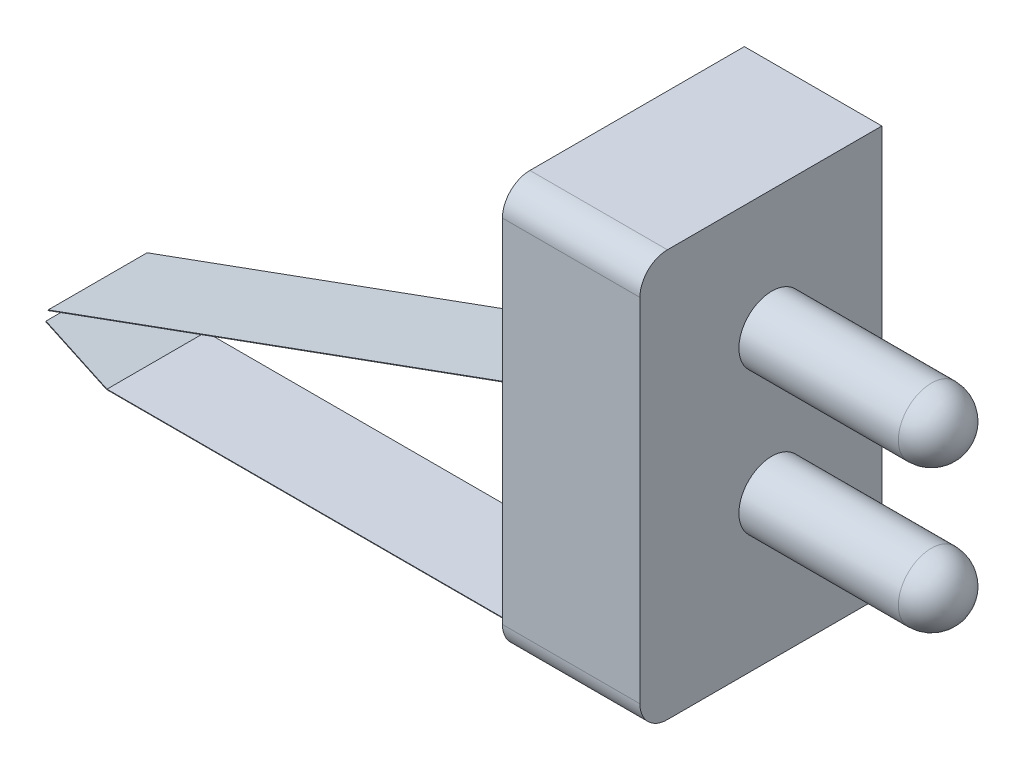
ISO-10303-21;
HEADER;
FILE_DESCRIPTION(('STEP AP214'),'2;1');
FILE_NAME('part.step','',(''),(''),'','','');
FILE_SCHEMA(('AUTOMOTIVE_DESIGN { 1 0 10303 214 1 1 1 1 }'));
ENDSEC;
DATA;
#1=APPLICATION_CONTEXT('core data for automotive mechanical design processes');
#2=APPLICATION_PROTOCOL_DEFINITION('international standard','automotive_design',2000,#1);
#3=PRODUCT_CONTEXT('',#1,'mechanical');
#4=PRODUCT('Part','Part','',(#3));
#5=PRODUCT_RELATED_PRODUCT_CATEGORY('part','',(#4));
#6=PRODUCT_DEFINITION_FORMATION('','',#4);
#7=PRODUCT_DEFINITION_CONTEXT('part definition',#1,'design');
#8=PRODUCT_DEFINITION('design','',#6,#7);
#9=PRODUCT_DEFINITION_SHAPE('','',#8);
#10=(LENGTH_UNIT() NAMED_UNIT(*) SI_UNIT(.MILLI.,.METRE.));
#11=(NAMED_UNIT(*) PLANE_ANGLE_UNIT() SI_UNIT($,.RADIAN.));
#12=(NAMED_UNIT(*) SI_UNIT($,.STERADIAN.) SOLID_ANGLE_UNIT());
#13=UNCERTAINTY_MEASURE_WITH_UNIT(LENGTH_MEASURE(1.E-05),#10,'distance_accuracy_value','');
#14=(GEOMETRIC_REPRESENTATION_CONTEXT(3) GLOBAL_UNCERTAINTY_ASSIGNED_CONTEXT((#13)) GLOBAL_UNIT_ASSIGNED_CONTEXT((#10,
#11,#12)) REPRESENTATION_CONTEXT('',''));
#15=CARTESIAN_POINT('',(0.,0.,0.));
#16=DIRECTION('',(0.,0.,1.));
#17=DIRECTION('',(1.,0.,0.));
#18=AXIS2_PLACEMENT_3D('',#15,#16,#17);
#19=CARTESIAN_POINT('',(-6.35,8.128,4.318));
#20=DIRECTION('',(1.,0.,0.));
#21=DIRECTION('',(0.,0.,-1.));
#22=AXIS2_PLACEMENT_3D('',#19,#20,#21);
#23=PLANE('',#22);
#24=DIRECTION('',(0.,0.,-1.));
#25=VECTOR('',#24,1.);
#26=CARTESIAN_POINT('',(-6.35,-9.398,4.31799999999999));
#27=LINE('',#26,#25);
#28=CARTESIAN_POINT('',(-6.35,-9.398,-2.794));
#29=VERTEX_POINT('',#28);
#30=CARTESIAN_POINT('',(-6.35,-9.398,-5.588));
#31=VERTEX_POINT('',#30);
#32=EDGE_CURVE('E350',#29,#31,#27,.T.);
#33=ORIENTED_EDGE('',*,*,#32,.F.);
#34=DIRECTION('',(0.,1.,0.));
#35=VECTOR('',#34,1.);
#36=CARTESIAN_POINT('',(-6.35,8.128,-2.794));
#37=LINE('',#36,#35);
#38=CARTESIAN_POINT('',(-6.35,-3.3915090287865,-2.794));
#39=VERTEX_POINT('',#38);
#40=EDGE_CURVE('E11',#29,#39,#37,.T.);
#41=ORIENTED_EDGE('',*,*,#40,.T.);
#42=DIRECTION('',(0.,0.,1.));
#43=VECTOR('',#42,1.);
#44=CARTESIAN_POINT('',(-6.35,-3.3915090287865,-2.794));
#45=LINE('',#44,#43);
#46=CARTESIAN_POINT('',(-6.35,-3.3915090287865,1.778));
#47=VERTEX_POINT('',#46);
#48=EDGE_CURVE('E307',#39,#47,#45,.T.);
#49=ORIENTED_EDGE('',*,*,#48,.T.);
#50=DIRECTION('',(0.,1.,0.));
#51=VECTOR('',#50,1.);
#52=CARTESIAN_POINT('',(-6.35,8.128,1.778));
#53=LINE('',#52,#51);
#54=CARTESIAN_POINT('',(-6.35,-9.398,1.778));
#55=VERTEX_POINT('',#54);
#56=EDGE_CURVE('E45',#55,#47,#53,.T.);
#57=ORIENTED_EDGE('',*,*,#56,.F.);
#58=CARTESIAN_POINT('',(-6.35,-9.398,4.31799999999999));
#59=VERTEX_POINT('',#58);
#60=EDGE_CURVE('E351',#59,#55,#27,.T.);
#61=ORIENTED_EDGE('',*,*,#60,.F.);
#62=CARTESIAN_POINT('',(-6.35,-8.128,4.318));
#63=DIRECTION('',(1.,0.,0.));
#64=DIRECTION('',(0.,0.,1.));
#65=AXIS2_PLACEMENT_3D('',#62,#63,#64);
#66=CIRCLE('',#65,1.27);
#67=CARTESIAN_POINT('',(-6.35,-8.12799999999999,5.588));
#68=VERTEX_POINT('',#67);
#69=EDGE_CURVE('E347',#68,#59,#66,.T.);
#70=ORIENTED_EDGE('',*,*,#69,.F.);
#71=DIRECTION('',(0.,-1.,0.));
#72=VECTOR('',#71,1.);
#73=CARTESIAN_POINT('',(-6.35,-8.12799999999999,5.588));
#74=LINE('',#73,#72);
#75=CARTESIAN_POINT('',(-6.35,8.12799999999999,5.588));
#76=VERTEX_POINT('',#75);
#77=EDGE_CURVE('E344',#76,#68,#74,.T.);
#78=ORIENTED_EDGE('',*,*,#77,.F.);
#79=CARTESIAN_POINT('',(-6.35,8.128,4.318));
#80=DIRECTION('',(1.,0.,0.));
#81=DIRECTION('',(0.,0.,-1.));
#82=AXIS2_PLACEMENT_3D('',#79,#80,#81);
#83=CIRCLE('',#82,1.27);
#84=CARTESIAN_POINT('',(-6.35,9.398,4.31799999999999));
#85=VERTEX_POINT('',#84);
#86=EDGE_CURVE('E341',#85,#76,#83,.T.);
#87=ORIENTED_EDGE('',*,*,#86,.F.);
#88=DIRECTION('',(0.,0.,1.));
#89=VECTOR('',#88,1.);
#90=CARTESIAN_POINT('',(-6.35,9.398,4.31799999999999));
#91=LINE('',#90,#89);
#92=CARTESIAN_POINT('',(-6.35,9.398,-5.588));
#93=VERTEX_POINT('',#92);
#94=EDGE_CURVE('E337',#93,#85,#91,.T.);
#95=ORIENTED_EDGE('',*,*,#94,.F.);
#96=DIRECTION('',(0.,1.,0.));
#97=VECTOR('',#96,1.);
#98=CARTESIAN_POINT('',(-6.35,-9.398,-5.588));
#99=LINE('',#98,#97);
#100=EDGE_CURVE('E334',#31,#93,#99,.T.);
#101=ORIENTED_EDGE('',*,*,#100,.F.);
#102=EDGE_LOOP('',(#33,#41,#49,#57,#61,#70,#78,#87,#95,#101));
#103=FACE_BOUND('',#102,.T.);
#104=DIRECTION('',(0.,1.,0.));
#105=VECTOR('',#104,1.);
#106=CARTESIAN_POINT('',(-6.35,5.17132830273649,-2.794));
#107=LINE('',#106,#105);
#108=CARTESIAN_POINT('',(-6.35,-0.851509028786498,-2.794));
#109=VERTEX_POINT('',#108);
#110=CARTESIAN_POINT('',(-6.35,5.17132830273649,-2.794));
#111=VERTEX_POINT('',#110);
#112=EDGE_CURVE('E202',#109,#111,#107,.T.);
#113=ORIENTED_EDGE('',*,*,#112,.T.);
#114=DIRECTION('',(0.,0.,1.));
#115=VECTOR('',#114,1.);
#116=CARTESIAN_POINT('',(-6.35,5.17132830273649,-2.794));
#117=LINE('',#116,#115);
#118=CARTESIAN_POINT('',(-6.35,5.17132830273649,1.778));
#119=VERTEX_POINT('',#118);
#120=EDGE_CURVE('E217',#111,#119,#117,.T.);
#121=ORIENTED_EDGE('',*,*,#120,.T.);
#122=DIRECTION('',(0.,1.,0.));
#123=VECTOR('',#122,1.);
#124=CARTESIAN_POINT('',(-6.35,5.17132830273649,1.778));
#125=LINE('',#124,#123);
#126=CARTESIAN_POINT('',(-6.35,-0.851509028786498,1.778));
#127=VERTEX_POINT('',#126);
#128=EDGE_CURVE('E218',#127,#119,#125,.T.);
#129=ORIENTED_EDGE('',*,*,#128,.F.);
#130=DIRECTION('',(0.,0.,1.));
#131=VECTOR('',#130,1.);
#132=CARTESIAN_POINT('',(-6.35,-0.851509028786498,-2.794));
#133=LINE('',#132,#131);
#134=EDGE_CURVE('E240',#109,#127,#133,.T.);
#135=ORIENTED_EDGE('',*,*,#134,.F.);
#136=EDGE_LOOP('',(#113,#121,#129,#135));
#137=FACE_BOUND('',#136,.T.);
#138=ADVANCED_FACE('F37',(#103,#137),#23,.F.);
#139=CARTESIAN_POINT('',(-6.35,-9.398,-5.588));
#140=DIRECTION('',(0.,0.,-1.));
#141=DIRECTION('',(-1.,0.,0.));
#142=AXIS2_PLACEMENT_3D('',#139,#140,#141);
#143=PLANE('',#142);
#144=DIRECTION('',(0.,1.,0.));
#145=VECTOR('',#144,1.);
#146=CARTESIAN_POINT('',(0.,-9.398,-5.588));
#147=LINE('',#146,#145);
#148=CARTESIAN_POINT('',(0.,-9.398,-5.588));
#149=VERTEX_POINT('',#148);
#150=CARTESIAN_POINT('',(0.,9.398,-5.588));
#151=VERTEX_POINT('',#150);
#152=EDGE_CURVE('E356',#149,#151,#147,.T.);
#153=ORIENTED_EDGE('',*,*,#152,.F.);
#154=DIRECTION('',(1.,0.,0.));
#155=VECTOR('',#154,1.);
#156=CARTESIAN_POINT('',(-6.35,-9.398,-5.588));
#157=LINE('',#156,#155);
#158=EDGE_CURVE('E373',#31,#149,#157,.T.);
#159=ORIENTED_EDGE('',*,*,#158,.F.);
#160=ORIENTED_EDGE('',*,*,#100,.T.);
#161=DIRECTION('',(1.,0.,0.));
#162=VECTOR('',#161,1.);
#163=CARTESIAN_POINT('',(-6.35,9.398,-5.588));
#164=LINE('',#163,#162);
#165=EDGE_CURVE('E354',#93,#151,#164,.T.);
#166=ORIENTED_EDGE('',*,*,#165,.T.);
#167=EDGE_LOOP('',(#153,#159,#160,#166));
#168=FACE_BOUND('',#167,.T.);
#169=ADVANCED_FACE('F438',(#168),#143,.T.);
#170=CARTESIAN_POINT('',(-6.35,-9.398,4.31799999999999));
#171=DIRECTION('',(0.,-1.,0.));
#172=DIRECTION('',(0.,0.,-1.));
#173=AXIS2_PLACEMENT_3D('',#170,#171,#172);
#174=PLANE('',#173);
#175=DIRECTION('',(0.,0.,-1.));
#176=VECTOR('',#175,1.);
#177=CARTESIAN_POINT('',(0.,-9.398,4.31799999999999));
#178=LINE('',#177,#176);
#179=CARTESIAN_POINT('',(0.,-9.398,4.31799999999999));
#180=VERTEX_POINT('',#179);
#181=EDGE_CURVE('E338',#180,#149,#178,.T.);
#182=ORIENTED_EDGE('',*,*,#181,.F.);
#183=DIRECTION('',(1.,0.,0.));
#184=VECTOR('',#183,1.);
#185=CARTESIAN_POINT('',(-6.35,-9.398,4.31799999999999));
#186=LINE('',#185,#184);
#187=EDGE_CURVE('E375',#59,#180,#186,.T.);
#188=ORIENTED_EDGE('',*,*,#187,.F.);
#189=ORIENTED_EDGE('',*,*,#60,.T.);
#190=EDGE_CURVE('E355',#55,#29,#27,.T.);
#191=ORIENTED_EDGE('',*,*,#190,.T.);
#192=ORIENTED_EDGE('',*,*,#32,.T.);
#193=ORIENTED_EDGE('',*,*,#158,.T.);
#194=EDGE_LOOP('',(#182,#188,#189,#191,#192,#193));
#195=FACE_BOUND('',#194,.T.);
#196=ADVANCED_FACE('F434',(#195),#174,.T.);
#197=CARTESIAN_POINT('',(-6.35,-8.128,4.318));
#198=DIRECTION('',(1.,0.,0.));
#199=DIRECTION('',(0.,0.,-1.));
#200=AXIS2_PLACEMENT_3D('',#197,#198,#199);
#201=CYLINDRICAL_SURFACE('',#200,1.27);
#202=CARTESIAN_POINT('',(0.,-8.128,4.318));
#203=DIRECTION('',(1.,0.,0.));
#204=DIRECTION('',(0.,0.,1.));
#205=AXIS2_PLACEMENT_3D('',#202,#203,#204);
#206=CIRCLE('',#205,1.27);
#207=CARTESIAN_POINT('',(0.,-8.12799999999999,5.588));
#208=VERTEX_POINT('',#207);
#209=EDGE_CURVE('E368',#208,#180,#206,.T.);
#210=ORIENTED_EDGE('',*,*,#209,.F.);
#211=DIRECTION('',(1.,0.,0.));
#212=VECTOR('',#211,1.);
#213=CARTESIAN_POINT('',(-6.35,-8.12799999999999,5.588));
#214=LINE('',#213,#212);
#215=EDGE_CURVE('E377',#68,#208,#214,.T.);
#216=ORIENTED_EDGE('',*,*,#215,.F.);
#217=ORIENTED_EDGE('',*,*,#69,.T.);
#218=ORIENTED_EDGE('',*,*,#187,.T.);
#219=EDGE_LOOP('',(#210,#216,#217,#218));
#220=FACE_BOUND('',#219,.T.);
#221=ADVANCED_FACE('F452',(#220),#201,.T.);
#222=CARTESIAN_POINT('',(-6.35,-8.12799999999999,5.588));
#223=DIRECTION('',(0.,0.,1.));
#224=DIRECTION('',(1.,0.,0.));
#225=AXIS2_PLACEMENT_3D('',#222,#223,#224);
#226=PLANE('',#225);
#227=DIRECTION('',(0.,-1.,0.));
#228=VECTOR('',#227,1.);
#229=CARTESIAN_POINT('',(0.,-8.12799999999999,5.588));
#230=LINE('',#229,#228);
#231=CARTESIAN_POINT('',(0.,8.12799999999999,5.588));
#232=VERTEX_POINT('',#231);
#233=EDGE_CURVE('E365',#232,#208,#230,.T.);
#234=ORIENTED_EDGE('',*,*,#233,.F.);
#235=DIRECTION('',(1.,0.,0.));
#236=VECTOR('',#235,1.);
#237=CARTESIAN_POINT('',(-6.35,8.12799999999999,5.588));
#238=LINE('',#237,#236);
#239=EDGE_CURVE('E379',#76,#232,#238,.T.);
#240=ORIENTED_EDGE('',*,*,#239,.F.);
#241=ORIENTED_EDGE('',*,*,#77,.T.);
#242=ORIENTED_EDGE('',*,*,#215,.T.);
#243=EDGE_LOOP('',(#234,#240,#241,#242));
#244=FACE_BOUND('',#243,.T.);
#245=ADVANCED_FACE('F455',(#244),#226,.T.);
#246=CARTESIAN_POINT('',(-6.35,8.128,4.318));
#247=DIRECTION('',(1.,0.,0.));
#248=DIRECTION('',(0.,0.,-1.));
#249=AXIS2_PLACEMENT_3D('',#246,#247,#248);
#250=CYLINDRICAL_SURFACE('',#249,1.27);
#251=CARTESIAN_POINT('',(0.,8.128,4.318));
#252=DIRECTION('',(1.,0.,0.));
#253=DIRECTION('',(0.,0.,-1.));
#254=AXIS2_PLACEMENT_3D('',#251,#252,#253);
#255=CIRCLE('',#254,1.27);
#256=CARTESIAN_POINT('',(0.,9.398,4.31799999999999));
#257=VERTEX_POINT('',#256);
#258=EDGE_CURVE('E362',#257,#232,#255,.T.);
#259=ORIENTED_EDGE('',*,*,#258,.F.);
#260=DIRECTION('',(1.,0.,0.));
#261=VECTOR('',#260,1.);
#262=CARTESIAN_POINT('',(-6.35,9.398,4.31799999999999));
#263=LINE('',#262,#261);
#264=EDGE_CURVE('E381',#85,#257,#263,.T.);
#265=ORIENTED_EDGE('',*,*,#264,.F.);
#266=ORIENTED_EDGE('',*,*,#86,.T.);
#267=ORIENTED_EDGE('',*,*,#239,.T.);
#268=EDGE_LOOP('',(#259,#265,#266,#267));
#269=FACE_BOUND('',#268,.T.);
#270=ADVANCED_FACE('F457',(#269),#250,.T.);
#271=CARTESIAN_POINT('',(-6.35,9.398,4.31799999999999));
#272=DIRECTION('',(0.,1.,0.));
#273=DIRECTION('',(0.,0.,1.));
#274=AXIS2_PLACEMENT_3D('',#271,#272,#273);
#275=PLANE('',#274);
#276=DIRECTION('',(0.,0.,1.));
#277=VECTOR('',#276,1.);
#278=CARTESIAN_POINT('',(0.,9.398,4.31799999999999));
#279=LINE('',#278,#277);
#280=EDGE_CURVE('E359',#151,#257,#279,.T.);
#281=ORIENTED_EDGE('',*,*,#280,.F.);
#282=ORIENTED_EDGE('',*,*,#165,.F.);
#283=ORIENTED_EDGE('',*,*,#94,.T.);
#284=ORIENTED_EDGE('',*,*,#264,.T.);
#285=EDGE_LOOP('',(#281,#282,#283,#284));
#286=FACE_BOUND('',#285,.T.);
#287=ADVANCED_FACE('F445',(#286),#275,.T.);
#288=CARTESIAN_POINT('',(0.,8.128,4.318));
#289=DIRECTION('',(1.,0.,0.));
#290=DIRECTION('',(0.,0.,-1.));
#291=AXIS2_PLACEMENT_3D('',#288,#289,#290);
#292=PLANE('',#291);
#293=CARTESIAN_POINT('',(0.,3.81,-0.508000000000002));
#294=DIRECTION('',(1.,0.,0.));
#295=DIRECTION('',(0.,0.,-1.));
#296=AXIS2_PLACEMENT_3D('',#293,#294,#295);
#297=CIRCLE('',#296,1.524);
#298=CARTESIAN_POINT('',(0.,3.81,-2.032));
#299=VERTEX_POINT('',#298);
#300=EDGE_CURVE('E327',#299,#299,#297,.T.);
#301=ORIENTED_EDGE('',*,*,#300,.F.);
#302=EDGE_LOOP('',(#301));
#303=FACE_BOUND('',#302,.T.);
#304=CARTESIAN_POINT('',(0.,-2.794,-0.508000000000002));
#305=DIRECTION('',(1.,0.,0.));
#306=DIRECTION('',(0.,0.,-1.));
#307=AXIS2_PLACEMENT_3D('',#304,#305,#306);
#308=CIRCLE('',#307,1.524);
#309=CARTESIAN_POINT('',(0.,-2.794,-2.032));
#310=VERTEX_POINT('',#309);
#311=EDGE_CURVE('E330',#310,#310,#308,.T.);
#312=ORIENTED_EDGE('',*,*,#311,.F.);
#313=EDGE_LOOP('',(#312));
#314=FACE_BOUND('',#313,.T.);
#315=ORIENTED_EDGE('',*,*,#152,.T.);
#316=ORIENTED_EDGE('',*,*,#280,.T.);
#317=ORIENTED_EDGE('',*,*,#258,.T.);
#318=ORIENTED_EDGE('',*,*,#233,.T.);
#319=ORIENTED_EDGE('',*,*,#209,.T.);
#320=ORIENTED_EDGE('',*,*,#181,.T.);
#321=EDGE_LOOP('',(#315,#316,#317,#318,#319,#320));
#322=FACE_BOUND('',#321,.T.);
#323=ADVANCED_FACE('F448',(#303,#314,#322),#292,.T.);
#324=CARTESIAN_POINT('',(7.366,-2.794,-0.508000000000002));
#325=DIRECTION('',(-1.,0.,0.));
#326=DIRECTION('',(0.,0.,1.));
#327=AXIS2_PLACEMENT_3D('',#324,#325,#326);
#328=CYLINDRICAL_SURFACE('',#327,1.524);
#329=CARTESIAN_POINT('',(7.366,-2.794,-0.508000000000002));
#330=DIRECTION('',(1.,0.,0.));
#331=DIRECTION('',(0.,0.,-1.));
#332=AXIS2_PLACEMENT_3D('',#329,#330,#331);
#333=CIRCLE('',#332,1.524);
#334=CARTESIAN_POINT('',(7.366,-2.794,-2.032));
#335=VERTEX_POINT('',#334);
#336=EDGE_CURVE('E333',#335,#335,#333,.T.);
#337=ORIENTED_EDGE('',*,*,#336,.F.);
#338=EDGE_LOOP('',(#337));
#339=FACE_BOUND('',#338,.T.);
#340=ORIENTED_EDGE('',*,*,#311,.T.);
#341=EDGE_LOOP('',(#340));
#342=FACE_BOUND('',#341,.T.);
#343=ADVANCED_FACE('F474',(#339,#342),#328,.T.);
#344=CARTESIAN_POINT('',(7.366,-2.794,-0.508000000000002));
#345=DIRECTION('',(0.,0.,1.));
#346=DIRECTION('',(1.,0.,0.));
#347=AXIS2_PLACEMENT_3D('',#344,#345,#346);
#348=SPHERICAL_SURFACE('',#347,1.524);
#349=CARTESIAN_POINT('',(7.366,-2.794,-0.508000000000002));
#350=DIRECTION('',(1.,0.,0.));
#351=DIRECTION('',(0.,0.,-1.));
#352=AXIS2_PLACEMENT_3D('',#349,#350,#351);
#353=SPHERICAL_SURFACE('',#352,1.524);
#354=ORIENTED_EDGE('',*,*,#336,.T.);
#355=EDGE_LOOP('',(#354));
#356=FACE_BOUND('',#355,.T.);
#357=ADVANCED_FACE('F39',(#356),#353,.T.);
#358=CARTESIAN_POINT('',(7.366,3.81,-0.508000000000002));
#359=DIRECTION('',(-1.,0.,0.));
#360=DIRECTION('',(0.,0.,1.));
#361=AXIS2_PLACEMENT_3D('',#358,#359,#360);
#362=CYLINDRICAL_SURFACE('',#361,1.524);
#363=CARTESIAN_POINT('',(7.366,3.81,-0.508000000000002));
#364=DIRECTION('',(1.,0.,0.));
#365=DIRECTION('',(0.,0.,-1.));
#366=AXIS2_PLACEMENT_3D('',#363,#364,#365);
#367=CIRCLE('',#366,1.524);
#368=CARTESIAN_POINT('',(7.366,3.81,-2.032));
#369=VERTEX_POINT('',#368);
#370=EDGE_CURVE('E309',#369,#369,#367,.T.);
#371=ORIENTED_EDGE('',*,*,#370,.F.);
#372=EDGE_LOOP('',(#371));
#373=FACE_BOUND('',#372,.T.);
#374=ORIENTED_EDGE('',*,*,#300,.T.);
#375=EDGE_LOOP('',(#374));
#376=FACE_BOUND('',#375,.T.);
#377=ADVANCED_FACE('F518',(#373,#376),#362,.T.);
#378=CARTESIAN_POINT('',(7.366,3.81,-0.508000000000002));
#379=DIRECTION('',(0.,0.,1.));
#380=DIRECTION('',(1.,0.,0.));
#381=AXIS2_PLACEMENT_3D('',#378,#379,#380);
#382=SPHERICAL_SURFACE('',#381,1.524);
#383=CARTESIAN_POINT('',(7.366,3.81,-0.508000000000002));
#384=DIRECTION('',(1.,0.,0.));
#385=DIRECTION('',(0.,0.,-1.));
#386=AXIS2_PLACEMENT_3D('',#383,#384,#385);
#387=SPHERICAL_SURFACE('',#386,1.524);
#388=ORIENTED_EDGE('',*,*,#370,.T.);
#389=EDGE_LOOP('',(#388));
#390=FACE_BOUND('',#389,.T.);
#391=ADVANCED_FACE('F523',(#390),#387,.T.);
#392=CARTESIAN_POINT('',(-6.35,-3.3915090287865,-2.794));
#393=DIRECTION('',(0.,1.,0.));
#394=DIRECTION('',(-1.,0.,0.));
#395=AXIS2_PLACEMENT_3D('',#392,#393,#394);
#396=PLANE('',#395);
#397=DIRECTION('',(-1.,0.,0.));
#398=VECTOR('',#397,1.);
#399=CARTESIAN_POINT('',(-6.35,-3.3915090287865,1.778));
#400=LINE('',#399,#398);
#401=CARTESIAN_POINT('',(-6.3754,-3.3915090287865,1.778));
#402=VERTEX_POINT('',#401);
#403=EDGE_CURVE('E239',#47,#402,#400,.T.);
#404=ORIENTED_EDGE('',*,*,#403,.F.);
#405=ORIENTED_EDGE('',*,*,#48,.F.);
#406=DIRECTION('',(-1.,0.,0.));
#407=VECTOR('',#406,1.);
#408=CARTESIAN_POINT('',(-6.35,-3.3915090287865,-2.794));
#409=LINE('',#408,#407);
#410=CARTESIAN_POINT('',(-6.3754,-3.3915090287865,-2.794));
#411=VERTEX_POINT('',#410);
#412=EDGE_CURVE('E247',#39,#411,#409,.T.);
#413=ORIENTED_EDGE('',*,*,#412,.T.);
#414=DIRECTION('',(0.,0.,1.));
#415=VECTOR('',#414,1.);
#416=CARTESIAN_POINT('',(-6.3754,-3.3915090287865,-2.794));
#417=LINE('',#416,#415);
#418=EDGE_CURVE('E278',#411,#402,#417,.T.);
#419=ORIENTED_EDGE('',*,*,#418,.T.);
#420=EDGE_LOOP('',(#404,#405,#413,#419));
#421=FACE_BOUND('',#420,.T.);
#422=ADVANCED_FACE('F394',(#421),#396,.T.);
#423=CARTESIAN_POINT('',(-6.35,-3.3915090287865,-2.794));
#424=DIRECTION('',(1.,0.,0.));
#425=DIRECTION('',(0.,1.,0.));
#426=AXIS2_PLACEMENT_3D('',#423,#424,#425);
#427=PLANE('',#426);
#428=DIRECTION('',(0.,1.,0.));
#429=VECTOR('',#428,1.);
#430=CARTESIAN_POINT('',(-6.35,-3.3915090287865,-2.794));
#431=LINE('',#430,#429);
#432=CARTESIAN_POINT('',(-6.35,-9.68399891999999,-2.794));
#433=VERTEX_POINT('',#432);
#434=EDGE_CURVE('E275',#433,#29,#431,.T.);
#435=ORIENTED_EDGE('',*,*,#434,.T.);
#436=ORIENTED_EDGE('',*,*,#190,.F.);
#437=DIRECTION('',(0.,1.,0.));
#438=VECTOR('',#437,1.);
#439=CARTESIAN_POINT('',(-6.35,-3.3915090287865,1.778));
#440=LINE('',#439,#438);
#441=CARTESIAN_POINT('',(-6.35,-9.68399891999999,1.778));
#442=VERTEX_POINT('',#441);
#443=EDGE_CURVE('E251',#442,#55,#440,.T.);
#444=ORIENTED_EDGE('',*,*,#443,.F.);
#445=DIRECTION('',(0.,0.,1.));
#446=VECTOR('',#445,1.);
#447=CARTESIAN_POINT('',(-6.35,-9.68399891999999,-2.794));
#448=LINE('',#447,#446);
#449=EDGE_CURVE('E310',#433,#442,#448,.T.);
#450=ORIENTED_EDGE('',*,*,#449,.F.);
#451=EDGE_LOOP('',(#435,#436,#444,#450));
#452=FACE_BOUND('',#451,.T.);
#453=ADVANCED_FACE('F428',(#452),#427,.T.);
#454=CARTESIAN_POINT('',(-8.35000108,-9.68399892,-2.794));
#455=DIRECTION('',(0.,0.,1.));
#456=DIRECTION('',(1.,0.,0.));
#457=AXIS2_PLACEMENT_3D('',#454,#455,#456);
#458=CYLINDRICAL_SURFACE('',#457,2.00000108);
#459=CARTESIAN_POINT('',(-8.35000108,-9.68399892,1.778));
#460=DIRECTION('',(0.,0.,1.));
#461=DIRECTION('',(-1.,0.,0.));
#462=AXIS2_PLACEMENT_3D('',#459,#460,#461);
#463=CIRCLE('',#462,2.00000108);
#464=CARTESIAN_POINT('',(-8.35000108000001,-11.684,1.778));
#465=VERTEX_POINT('',#464);
#466=EDGE_CURVE('E302',#465,#442,#463,.T.);
#467=ORIENTED_EDGE('',*,*,#466,.F.);
#468=DIRECTION('',(0.,0.,1.));
#469=VECTOR('',#468,1.);
#470=CARTESIAN_POINT('',(-8.35000108000001,-11.684,-2.794));
#471=LINE('',#470,#469);
#472=CARTESIAN_POINT('',(-8.35000108000001,-11.684,-2.794));
#473=VERTEX_POINT('',#472);
#474=EDGE_CURVE('E312',#473,#465,#471,.T.);
#475=ORIENTED_EDGE('',*,*,#474,.F.);
#476=CARTESIAN_POINT('',(-8.35000108,-9.68399892,-2.794));
#477=DIRECTION('',(0.,0.,1.));
#478=DIRECTION('',(-1.,0.,0.));
#479=AXIS2_PLACEMENT_3D('',#476,#477,#478);
#480=CIRCLE('',#479,2.00000108);
#481=EDGE_CURVE('E272',#473,#433,#480,.T.);
#482=ORIENTED_EDGE('',*,*,#481,.T.);
#483=ORIENTED_EDGE('',*,*,#449,.T.);
#484=EDGE_LOOP('',(#467,#475,#482,#483));
#485=FACE_BOUND('',#484,.T.);
#486=ADVANCED_FACE('F573',(#485),#458,.T.);
#487=CARTESIAN_POINT('',(-8.35000108000001,-11.684,-2.794));
#488=DIRECTION('',(0.,-1.,0.));
#489=DIRECTION('',(1.,0.,0.));
#490=AXIS2_PLACEMENT_3D('',#487,#488,#489);
#491=PLANE('',#490);
#492=DIRECTION('',(1.,0.,0.));
#493=VECTOR('',#492,1.);
#494=CARTESIAN_POINT('',(-8.35000108000001,-11.684,1.778));
#495=LINE('',#494,#493);
#496=CARTESIAN_POINT('',(-28.448,-11.684,1.778));
#497=VERTEX_POINT('',#496);
#498=EDGE_CURVE('E299',#497,#465,#495,.T.);
#499=ORIENTED_EDGE('',*,*,#498,.F.);
#500=DIRECTION('',(0.,0.,1.));
#501=VECTOR('',#500,1.);
#502=CARTESIAN_POINT('',(-28.448,-11.684,-2.794));
#503=LINE('',#502,#501);
#504=CARTESIAN_POINT('',(-28.448,-11.684,-2.794));
#505=VERTEX_POINT('',#504);
#506=EDGE_CURVE('E314',#505,#497,#503,.T.);
#507=ORIENTED_EDGE('',*,*,#506,.F.);
#508=DIRECTION('',(1.,0.,0.));
#509=VECTOR('',#508,1.);
#510=CARTESIAN_POINT('',(-8.35000108000001,-11.684,-2.794));
#511=LINE('',#510,#509);
#512=EDGE_CURVE('E269',#505,#473,#511,.T.);
#513=ORIENTED_EDGE('',*,*,#512,.T.);
#514=ORIENTED_EDGE('',*,*,#474,.T.);
#515=EDGE_LOOP('',(#499,#507,#513,#514));
#516=FACE_BOUND('',#515,.T.);
#517=ADVANCED_FACE('F423',(#516),#491,.T.);
#518=CARTESIAN_POINT('',(-28.448,-11.684,-2.794));
#519=DIRECTION('',(-0.4226182617407,-0.906307787036649,0.));
#520=DIRECTION('',(0.906307787036649,-0.4226182617407,0.));
#521=AXIS2_PLACEMENT_3D('',#518,#519,#520);
#522=PLANE('',#521);
#523=DIRECTION('',(0.906307787036649,-0.4226182617407,0.));
#524=VECTOR('',#523,1.);
#525=CARTESIAN_POINT('',(-28.448,-11.684,1.778));
#526=LINE('',#525,#524);
#527=CARTESIAN_POINT('',(-31.242,-10.3811364031149,1.778));
#528=VERTEX_POINT('',#527);
#529=EDGE_CURVE('E296',#528,#497,#526,.T.);
#530=ORIENTED_EDGE('',*,*,#529,.F.);
#531=DIRECTION('',(0.,0.,1.));
#532=VECTOR('',#531,1.);
#533=CARTESIAN_POINT('',(-31.242,-10.3811364031149,-2.794));
#534=LINE('',#533,#532);
#535=CARTESIAN_POINT('',(-31.242,-10.3811364031149,-2.794));
#536=VERTEX_POINT('',#535);
#537=EDGE_CURVE('E316',#536,#528,#534,.T.);
#538=ORIENTED_EDGE('',*,*,#537,.F.);
#539=DIRECTION('',(0.906307787036649,-0.4226182617407,0.));
#540=VECTOR('',#539,1.);
#541=CARTESIAN_POINT('',(-28.448,-11.684,-2.794));
#542=LINE('',#541,#540);
#543=EDGE_CURVE('E266',#536,#505,#542,.T.);
#544=ORIENTED_EDGE('',*,*,#543,.T.);
#545=ORIENTED_EDGE('',*,*,#506,.T.);
#546=EDGE_LOOP('',(#530,#538,#544,#545));
#547=FACE_BOUND('',#546,.T.);
#548=ADVANCED_FACE('F419',(#547),#522,.T.);
#549=CARTESIAN_POINT('',(-31.242,-10.3443251730549,-2.794));
#550=DIRECTION('',(-1.,0.,0.));
#551=DIRECTION('',(0.,0.,1.));
#552=AXIS2_PLACEMENT_3D('',#549,#550,#551);
#553=PLANE('',#552);
#554=DIRECTION('',(0.,-1.,0.));
#555=VECTOR('',#554,1.);
#556=CARTESIAN_POINT('',(-31.242,-10.3443251730549,1.778));
#557=LINE('',#556,#555);
#558=CARTESIAN_POINT('',(-31.242,-10.3443251730549,1.778));
#559=VERTEX_POINT('',#558);
#560=EDGE_CURVE('E293',#559,#528,#557,.T.);
#561=ORIENTED_EDGE('',*,*,#560,.F.);
#562=DIRECTION('',(0.,0.,1.));
#563=VECTOR('',#562,1.);
#564=CARTESIAN_POINT('',(-31.242,-10.3443251730549,-2.794));
#565=LINE('',#564,#563);
#566=CARTESIAN_POINT('',(-31.242,-10.3443251730549,-2.794));
#567=VERTEX_POINT('',#566);
#568=EDGE_CURVE('E318',#567,#559,#565,.T.);
#569=ORIENTED_EDGE('',*,*,#568,.F.);
#570=DIRECTION('',(0.,-1.,0.));
#571=VECTOR('',#570,1.);
#572=CARTESIAN_POINT('',(-31.242,-10.3443251730549,-2.794));
#573=LINE('',#572,#571);
#574=EDGE_CURVE('E263',#567,#536,#573,.T.);
#575=ORIENTED_EDGE('',*,*,#574,.T.);
#576=ORIENTED_EDGE('',*,*,#537,.T.);
#577=EDGE_LOOP('',(#561,#569,#575,#576));
#578=FACE_BOUND('',#577,.T.);
#579=ADVANCED_FACE('F415',(#578),#553,.T.);
#580=CARTESIAN_POINT('',(-28.4248123593041,-11.6586,-2.794));
#581=DIRECTION('',(0.422776435852255,0.906234012431703,0.));
#582=DIRECTION('',(-0.906234012431703,0.422776435852255,0.));
#583=AXIS2_PLACEMENT_3D('',#580,#581,#582);
#584=PLANE('',#583);
#585=DIRECTION('',(-0.906234012431703,0.422776435852255,0.));
#586=VECTOR('',#585,1.);
#587=CARTESIAN_POINT('',(-28.4248123593041,-11.6586,1.778));
#588=LINE('',#587,#586);
#589=CARTESIAN_POINT('',(-28.4248123593041,-11.6586,1.778));
#590=VERTEX_POINT('',#589);
#591=EDGE_CURVE('E290',#590,#559,#588,.T.);
#592=ORIENTED_EDGE('',*,*,#591,.F.);
#593=DIRECTION('',(0.,0.,1.));
#594=VECTOR('',#593,1.);
#595=CARTESIAN_POINT('',(-28.4248123593041,-11.6586,-2.794));
#596=LINE('',#595,#594);
#597=CARTESIAN_POINT('',(-28.4248123593041,-11.6586,-2.794));
#598=VERTEX_POINT('',#597);
#599=EDGE_CURVE('E320',#598,#590,#596,.T.);
#600=ORIENTED_EDGE('',*,*,#599,.F.);
#601=DIRECTION('',(-0.906234012431703,0.422776435852255,0.));
#602=VECTOR('',#601,1.);
#603=CARTESIAN_POINT('',(-28.4248123593041,-11.6586,-2.794));
#604=LINE('',#603,#602);
#605=EDGE_CURVE('E260',#598,#567,#604,.T.);
#606=ORIENTED_EDGE('',*,*,#605,.T.);
#607=ORIENTED_EDGE('',*,*,#568,.T.);
#608=EDGE_LOOP('',(#592,#600,#606,#607));
#609=FACE_BOUND('',#608,.T.);
#610=ADVANCED_FACE('F411',(#609),#584,.T.);
#611=CARTESIAN_POINT('',(-8.35000108000001,-11.6586,-2.794));
#612=DIRECTION('',(0.,1.,0.));
#613=DIRECTION('',(-1.,0.,0.));
#614=AXIS2_PLACEMENT_3D('',#611,#612,#613);
#615=PLANE('',#614);
#616=DIRECTION('',(-1.,0.,0.));
#617=VECTOR('',#616,1.);
#618=CARTESIAN_POINT('',(-8.35000108000001,-11.6586,1.778));
#619=LINE('',#618,#617);
#620=CARTESIAN_POINT('',(-8.35000108000001,-11.6586,1.778));
#621=VERTEX_POINT('',#620);
#622=EDGE_CURVE('E287',#621,#590,#619,.T.);
#623=ORIENTED_EDGE('',*,*,#622,.F.);
#624=DIRECTION('',(0.,0.,1.));
#625=VECTOR('',#624,1.);
#626=CARTESIAN_POINT('',(-8.35000108000001,-11.6586,-2.794));
#627=LINE('',#626,#625);
#628=CARTESIAN_POINT('',(-8.35000108000001,-11.6586,-2.794));
#629=VERTEX_POINT('',#628);
#630=EDGE_CURVE('E322',#629,#621,#627,.T.);
#631=ORIENTED_EDGE('',*,*,#630,.F.);
#632=DIRECTION('',(-1.,0.,0.));
#633=VECTOR('',#632,1.);
#634=CARTESIAN_POINT('',(-8.35000108000001,-11.6586,-2.794));
#635=LINE('',#634,#633);
#636=EDGE_CURVE('E257',#629,#598,#635,.T.);
#637=ORIENTED_EDGE('',*,*,#636,.T.);
#638=ORIENTED_EDGE('',*,*,#599,.T.);
#639=EDGE_LOOP('',(#623,#631,#637,#638));
#640=FACE_BOUND('',#639,.T.);
#641=ADVANCED_FACE('F407',(#640),#615,.T.);
#642=CARTESIAN_POINT('',(-8.35000108000001,-9.68399891999999,-2.794));
#643=DIRECTION('',(0.,0.,1.));
#644=DIRECTION('',(1.,0.,0.));
#645=AXIS2_PLACEMENT_3D('',#642,#643,#644);
#646=CYLINDRICAL_SURFACE('',#645,1.97460108000001);
#647=CARTESIAN_POINT('',(-8.35000108000001,-9.68399891999999,1.778));
#648=DIRECTION('',(0.,0.,-1.));
#649=DIRECTION('',(-1.,0.,0.));
#650=AXIS2_PLACEMENT_3D('',#647,#648,#649);
#651=CIRCLE('',#650,1.97460108000001);
#652=CARTESIAN_POINT('',(-6.3754,-9.68399891999999,1.778));
#653=VERTEX_POINT('',#652);
#654=EDGE_CURVE('E284',#653,#621,#651,.T.);
#655=ORIENTED_EDGE('',*,*,#654,.F.);
#656=DIRECTION('',(0.,0.,1.));
#657=VECTOR('',#656,1.);
#658=CARTESIAN_POINT('',(-6.3754,-9.68399891999999,-2.794));
#659=LINE('',#658,#657);
#660=CARTESIAN_POINT('',(-6.3754,-9.68399891999999,-2.794));
#661=VERTEX_POINT('',#660);
#662=EDGE_CURVE('E324',#661,#653,#659,.T.);
#663=ORIENTED_EDGE('',*,*,#662,.F.);
#664=CARTESIAN_POINT('',(-8.35000108000001,-9.68399891999999,-2.794));
#665=DIRECTION('',(0.,0.,-1.));
#666=DIRECTION('',(-1.,0.,0.));
#667=AXIS2_PLACEMENT_3D('',#664,#665,#666);
#668=CIRCLE('',#667,1.97460108000001);
#669=EDGE_CURVE('E254',#661,#629,#668,.T.);
#670=ORIENTED_EDGE('',*,*,#669,.T.);
#671=ORIENTED_EDGE('',*,*,#630,.T.);
#672=EDGE_LOOP('',(#655,#663,#670,#671));
#673=FACE_BOUND('',#672,.T.);
#674=ADVANCED_FACE('F403',(#673),#646,.F.);
#675=CARTESIAN_POINT('',(-6.3754,-3.3915090287865,-2.794));
#676=DIRECTION('',(-1.,0.,0.));
#677=DIRECTION('',(0.,0.,1.));
#678=AXIS2_PLACEMENT_3D('',#675,#676,#677);
#679=PLANE('',#678);
#680=DIRECTION('',(0.,-1.,0.));
#681=VECTOR('',#680,1.);
#682=CARTESIAN_POINT('',(-6.3754,-3.3915090287865,1.778));
#683=LINE('',#682,#681);
#684=EDGE_CURVE('E281',#402,#653,#683,.T.);
#685=ORIENTED_EDGE('',*,*,#684,.F.);
#686=ORIENTED_EDGE('',*,*,#418,.F.);
#687=DIRECTION('',(0.,-1.,0.));
#688=VECTOR('',#687,1.);
#689=CARTESIAN_POINT('',(-6.3754,-3.3915090287865,-2.794));
#690=LINE('',#689,#688);
#691=EDGE_CURVE('E250',#411,#661,#690,.T.);
#692=ORIENTED_EDGE('',*,*,#691,.T.);
#693=ORIENTED_EDGE('',*,*,#662,.T.);
#694=EDGE_LOOP('',(#685,#686,#692,#693));
#695=FACE_BOUND('',#694,.T.);
#696=ADVANCED_FACE('F399',(#695),#679,.T.);
#697=CARTESIAN_POINT('',(-8.35000108000001,-9.68399891999999,-2.794));
#698=DIRECTION('',(0.,0.,-1.));
#699=DIRECTION('',(-1.,0.,0.));
#700=AXIS2_PLACEMENT_3D('',#697,#698,#699);
#701=PLANE('',#700);
#702=ORIENTED_EDGE('',*,*,#412,.F.);
#703=ORIENTED_EDGE('',*,*,#40,.F.);
#704=ORIENTED_EDGE('',*,*,#434,.F.);
#705=ORIENTED_EDGE('',*,*,#481,.F.);
#706=ORIENTED_EDGE('',*,*,#512,.F.);
#707=ORIENTED_EDGE('',*,*,#543,.F.);
#708=ORIENTED_EDGE('',*,*,#574,.F.);
#709=ORIENTED_EDGE('',*,*,#605,.F.);
#710=ORIENTED_EDGE('',*,*,#636,.F.);
#711=ORIENTED_EDGE('',*,*,#669,.F.);
#712=ORIENTED_EDGE('',*,*,#691,.F.);
#713=EDGE_LOOP('',(#702,#703,#704,#705,#706,#707,#708,#709,#710,#711,#712));
#714=FACE_BOUND('',#713,.T.);
#715=ADVANCED_FACE('F646',(#714),#701,.T.);
#716=CARTESIAN_POINT('',(-8.35000108000001,-9.68399891999999,1.778));
#717=DIRECTION('',(0.,0.,-1.));
#718=DIRECTION('',(-1.,0.,0.));
#719=AXIS2_PLACEMENT_3D('',#716,#717,#718);
#720=PLANE('',#719);
#721=ORIENTED_EDGE('',*,*,#403,.T.);
#722=ORIENTED_EDGE('',*,*,#684,.T.);
#723=ORIENTED_EDGE('',*,*,#654,.T.);
#724=ORIENTED_EDGE('',*,*,#622,.T.);
#725=ORIENTED_EDGE('',*,*,#591,.T.);
#726=ORIENTED_EDGE('',*,*,#560,.T.);
#727=ORIENTED_EDGE('',*,*,#529,.T.);
#728=ORIENTED_EDGE('',*,*,#498,.T.);
#729=ORIENTED_EDGE('',*,*,#466,.T.);
#730=ORIENTED_EDGE('',*,*,#443,.T.);
#731=ORIENTED_EDGE('',*,*,#56,.T.);
#732=EDGE_LOOP('',(#721,#722,#723,#724,#725,#726,#727,#728,#729,#730,#731));
#733=FACE_BOUND('',#732,.T.);
#734=ADVANCED_FACE('F390',(#733),#720,.F.);
#735=CARTESIAN_POINT('',(-6.3627,5.17132830273649,-2.794));
#736=DIRECTION('',(0.,0.,1.));
#737=DIRECTION('',(1.,0.,0.));
#738=AXIS2_PLACEMENT_3D('',#735,#736,#737);
#739=CYLINDRICAL_SURFACE('',#738,0.0127000000000009);
#740=CARTESIAN_POINT('',(-6.3627,5.17132830273649,1.778));
#741=DIRECTION('',(0.,0.,1.));
#742=DIRECTION('',(1.,0.,0.));
#743=AXIS2_PLACEMENT_3D('',#740,#741,#742);
#744=CIRCLE('',#743,0.0127000000000009);
#745=CARTESIAN_POINT('',(-6.3754,5.17132830273649,1.778));
#746=VERTEX_POINT('',#745);
#747=EDGE_CURVE('E229',#119,#746,#744,.T.);
#748=ORIENTED_EDGE('',*,*,#747,.F.);
#749=ORIENTED_EDGE('',*,*,#120,.F.);
#750=CARTESIAN_POINT('',(-6.3627,5.17132830273649,-2.794));
#751=DIRECTION('',(0.,0.,1.));
#752=DIRECTION('',(1.,0.,0.));
#753=AXIS2_PLACEMENT_3D('',#750,#751,#752);
#754=CIRCLE('',#753,0.0127000000000009);
#755=CARTESIAN_POINT('',(-6.3754,5.17132830273649,-2.794));
#756=VERTEX_POINT('',#755);
#757=EDGE_CURVE('E209',#111,#756,#754,.T.);
#758=ORIENTED_EDGE('',*,*,#757,.T.);
#759=DIRECTION('',(0.,0.,1.));
#760=VECTOR('',#759,1.);
#761=CARTESIAN_POINT('',(-6.3754,5.17132830273649,-2.794));
#762=LINE('',#761,#760);
#763=EDGE_CURVE('E192',#756,#746,#762,.T.);
#764=ORIENTED_EDGE('',*,*,#763,.T.);
#765=EDGE_LOOP('',(#748,#749,#758,#764));
#766=FACE_BOUND('',#765,.T.);
#767=ADVANCED_FACE('F215',(#766),#739,.T.);
#768=CARTESIAN_POINT('',(-6.35,-0.851509028786498,-2.794));
#769=DIRECTION('',(0.342020143325666,-0.939692620785909,0.));
#770=DIRECTION('',(0.939692620785909,0.342020143325666,0.));
#771=AXIS2_PLACEMENT_3D('',#768,#769,#770);
#772=PLANE('',#771);
#773=DIRECTION('',(0.939692620785909,0.342020143325666,0.));
#774=VECTOR('',#773,1.);
#775=CARTESIAN_POINT('',(-6.35,-0.851509028786498,1.778));
#776=LINE('',#775,#774);
#777=CARTESIAN_POINT('',(-31.1441613402053,-9.87584574021497,1.778));
#778=VERTEX_POINT('',#777);
#779=EDGE_CURVE('E52',#778,#127,#776,.T.);
#780=ORIENTED_EDGE('',*,*,#779,.F.);
#781=DIRECTION('',(0.,0.,1.));
#782=VECTOR('',#781,1.);
#783=CARTESIAN_POINT('',(-31.1441613402053,-9.87584574021497,-2.794));
#784=LINE('',#783,#782);
#785=CARTESIAN_POINT('',(-31.1441613402053,-9.87584574021497,-2.794));
#786=VERTEX_POINT('',#785);
#787=EDGE_CURVE('E242',#786,#778,#784,.T.);
#788=ORIENTED_EDGE('',*,*,#787,.F.);
#789=DIRECTION('',(0.939692620785909,0.342020143325666,0.));
#790=VECTOR('',#789,1.);
#791=CARTESIAN_POINT('',(-6.35,-0.851509028786498,-2.794));
#792=LINE('',#791,#790);
#793=EDGE_CURVE('E226',#786,#109,#792,.T.);
#794=ORIENTED_EDGE('',*,*,#793,.T.);
#795=ORIENTED_EDGE('',*,*,#134,.T.);
#796=EDGE_LOOP('',(#780,#788,#794,#795));
#797=FACE_BOUND('',#796,.T.);
#798=ADVANCED_FACE('F680',(#797),#772,.T.);
#799=CARTESIAN_POINT('',(-31.1441613402053,-9.84881562479408,-2.794));
#800=DIRECTION('',(-1.,0.,0.));
#801=DIRECTION('',(0.,0.,1.));
#802=AXIS2_PLACEMENT_3D('',#799,#800,#801);
#803=PLANE('',#802);
#804=DIRECTION('',(0.,-1.,0.));
#805=VECTOR('',#804,1.);
#806=CARTESIAN_POINT('',(-31.1441613402053,-9.84881562479408,1.778));
#807=LINE('',#806,#805);
#808=CARTESIAN_POINT('',(-31.1441613402053,-9.84881562479408,1.778));
#809=VERTEX_POINT('',#808);
#810=EDGE_CURVE('E235',#809,#778,#807,.T.);
#811=ORIENTED_EDGE('',*,*,#810,.F.);
#812=DIRECTION('',(0.,0.,1.));
#813=VECTOR('',#812,1.);
#814=CARTESIAN_POINT('',(-31.1441613402053,-9.84881562479408,-2.794));
#815=LINE('',#814,#813);
#816=CARTESIAN_POINT('',(-31.1441613402053,-9.84881562479408,-2.794));
#817=VERTEX_POINT('',#816);
#818=EDGE_CURVE('E244',#817,#809,#815,.T.);
#819=ORIENTED_EDGE('',*,*,#818,.F.);
#820=DIRECTION('',(0.,-1.,0.));
#821=VECTOR('',#820,1.);
#822=CARTESIAN_POINT('',(-31.1441613402053,-9.84881562479408,-2.794));
#823=LINE('',#822,#821);
#824=EDGE_CURVE('E223',#817,#786,#823,.T.);
#825=ORIENTED_EDGE('',*,*,#824,.T.);
#826=ORIENTED_EDGE('',*,*,#787,.T.);
#827=EDGE_LOOP('',(#811,#819,#825,#826));
#828=FACE_BOUND('',#827,.T.);
#829=ADVANCED_FACE('F689',(#828),#803,.T.);
#830=CARTESIAN_POINT('',(-6.3754,-0.833723757315971,-2.794));
#831=DIRECTION('',(-0.342020143325666,0.939692620785909,0.));
#832=DIRECTION('',(-0.93969262078591,-0.342020143325666,0.));
#833=AXIS2_PLACEMENT_3D('',#830,#831,#832);
#834=PLANE('',#833);
#835=DIRECTION('',(-0.939692620785909,-0.342020143325666,0.));
#836=VECTOR('',#835,1.);
#837=CARTESIAN_POINT('',(-6.3754,-0.833723757315971,1.778));
#838=LINE('',#837,#836);
#839=CARTESIAN_POINT('',(-6.3754,-0.833723757315971,1.778));
#840=VERTEX_POINT('',#839);
#841=EDGE_CURVE('E232',#840,#809,#838,.T.);
#842=ORIENTED_EDGE('',*,*,#841,.F.);
#843=DIRECTION('',(0.,0.,1.));
#844=VECTOR('',#843,1.);
#845=CARTESIAN_POINT('',(-6.3754,-0.833723757315971,-2.794));
#846=LINE('',#845,#844);
#847=CARTESIAN_POINT('',(-6.3754,-0.833723757315971,-2.794));
#848=VERTEX_POINT('',#847);
#849=EDGE_CURVE('E201',#848,#840,#846,.T.);
#850=ORIENTED_EDGE('',*,*,#849,.F.);
#851=DIRECTION('',(-0.939692620785909,-0.342020143325666,0.));
#852=VECTOR('',#851,1.);
#853=CARTESIAN_POINT('',(-6.3754,-0.833723757315971,-2.794));
#854=LINE('',#853,#852);
#855=EDGE_CURVE('E213',#848,#817,#854,.T.);
#856=ORIENTED_EDGE('',*,*,#855,.T.);
#857=ORIENTED_EDGE('',*,*,#818,.T.);
#858=EDGE_LOOP('',(#842,#850,#856,#857));
#859=FACE_BOUND('',#858,.T.);
#860=ADVANCED_FACE('F700',(#859),#834,.T.);
#861=CARTESIAN_POINT('',(-6.3754,5.17132830273649,-2.794));
#862=DIRECTION('',(-1.,0.,0.));
#863=DIRECTION('',(0.,-1.,0.));
#864=AXIS2_PLACEMENT_3D('',#861,#862,#863);
#865=PLANE('',#864);
#866=DIRECTION('',(0.,-1.,0.));
#867=VECTOR('',#866,1.);
#868=CARTESIAN_POINT('',(-6.3754,5.17132830273649,1.778));
#869=LINE('',#868,#867);
#870=EDGE_CURVE('E197',#746,#840,#869,.T.);
#871=ORIENTED_EDGE('',*,*,#870,.F.);
#872=ORIENTED_EDGE('',*,*,#763,.F.);
#873=DIRECTION('',(0.,-1.,0.));
#874=VECTOR('',#873,1.);
#875=CARTESIAN_POINT('',(-6.3754,5.17132830273649,-2.794));
#876=LINE('',#875,#874);
#877=EDGE_CURVE('E195',#756,#848,#876,.T.);
#878=ORIENTED_EDGE('',*,*,#877,.T.);
#879=ORIENTED_EDGE('',*,*,#849,.T.);
#880=EDGE_LOOP('',(#871,#872,#878,#879));
#881=FACE_BOUND('',#880,.T.);
#882=ADVANCED_FACE('F194',(#881),#865,.T.);
#883=CARTESIAN_POINT('',(-6.3627,5.17132830273649,-2.794));
#884=DIRECTION('',(0.,0.,1.));
#885=DIRECTION('',(1.,0.,0.));
#886=AXIS2_PLACEMENT_3D('',#883,#884,#885);
#887=PLANE('',#886);
#888=ORIENTED_EDGE('',*,*,#757,.F.);
#889=ORIENTED_EDGE('',*,*,#112,.F.);
#890=ORIENTED_EDGE('',*,*,#793,.F.);
#891=ORIENTED_EDGE('',*,*,#824,.F.);
#892=ORIENTED_EDGE('',*,*,#855,.F.);
#893=ORIENTED_EDGE('',*,*,#877,.F.);
#894=EDGE_LOOP('',(#888,#889,#890,#891,#892,#893));
#895=FACE_BOUND('',#894,.T.);
#896=ADVANCED_FACE('F207',(#895),#887,.F.);
#897=CARTESIAN_POINT('',(-6.3627,5.17132830273649,1.778));
#898=DIRECTION('',(0.,0.,1.));
#899=DIRECTION('',(1.,0.,0.));
#900=AXIS2_PLACEMENT_3D('',#897,#898,#899);
#901=PLANE('',#900);
#902=ORIENTED_EDGE('',*,*,#747,.T.);
#903=ORIENTED_EDGE('',*,*,#870,.T.);
#904=ORIENTED_EDGE('',*,*,#841,.T.);
#905=ORIENTED_EDGE('',*,*,#810,.T.);
#906=ORIENTED_EDGE('',*,*,#779,.T.);
#907=ORIENTED_EDGE('',*,*,#128,.T.);
#908=EDGE_LOOP('',(#902,#903,#904,#905,#906,#907));
#909=FACE_BOUND('',#908,.T.);
#910=ADVANCED_FACE('F730',(#909),#901,.T.);
#911=CLOSED_SHELL('',(#138,#169,#196,#221,#245,#270,#287,#323,#343,#357,#377,#391,#422,#453,
#486,#517,#548,#579,#610,#641,#674,#696,#715,#734,#767,#798,#829,#860,#882,#896,#910));
#912=MANIFOLD_SOLID_BREP('B2',#911);
#913=ADVANCED_BREP_SHAPE_REPRESENTATION('',(#18,#912),#14);
#914=SHAPE_DEFINITION_REPRESENTATION(#9,#913);
ENDSEC;
END-ISO-10303-21;
